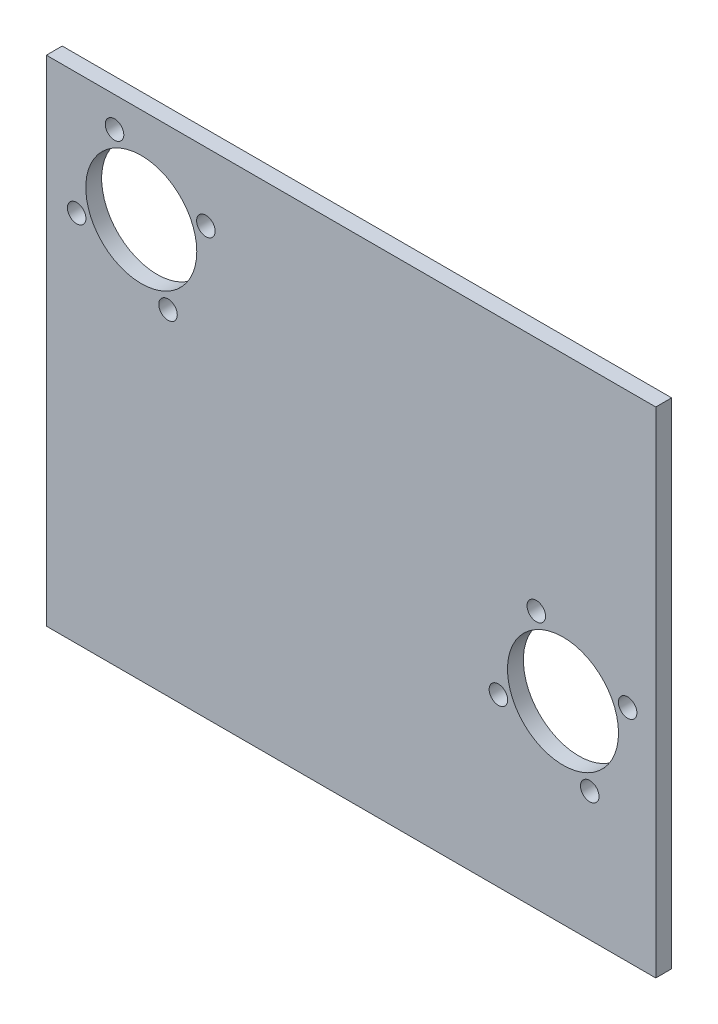
ISO-10303-21;
HEADER;
FILE_DESCRIPTION(('STEP AP214'),'2;1');
FILE_NAME('part.step','',(''),(''),'','','');
FILE_SCHEMA(('AUTOMOTIVE_DESIGN { 1 0 10303 214 1 1 1 1 }'));
ENDSEC;
DATA;
#1=APPLICATION_CONTEXT('core data for automotive mechanical design processes');
#2=APPLICATION_PROTOCOL_DEFINITION('international standard','automotive_design',2000,#1);
#3=PRODUCT_CONTEXT('',#1,'mechanical');
#4=PRODUCT('Part','Part','',(#3));
#5=PRODUCT_RELATED_PRODUCT_CATEGORY('part','',(#4));
#6=PRODUCT_DEFINITION_FORMATION('','',#4);
#7=PRODUCT_DEFINITION_CONTEXT('part definition',#1,'design');
#8=PRODUCT_DEFINITION('design','',#6,#7);
#9=PRODUCT_DEFINITION_SHAPE('','',#8);
#10=(LENGTH_UNIT() NAMED_UNIT(*) SI_UNIT(.MILLI.,.METRE.));
#11=(NAMED_UNIT(*) PLANE_ANGLE_UNIT() SI_UNIT($,.RADIAN.));
#12=(NAMED_UNIT(*) SI_UNIT($,.STERADIAN.) SOLID_ANGLE_UNIT());
#13=UNCERTAINTY_MEASURE_WITH_UNIT(LENGTH_MEASURE(1.E-05),#10,'distance_accuracy_value','');
#14=(GEOMETRIC_REPRESENTATION_CONTEXT(3) GLOBAL_UNCERTAINTY_ASSIGNED_CONTEXT((#13)) GLOBAL_UNIT_ASSIGNED_CONTEXT((#10,
#11,#12)) REPRESENTATION_CONTEXT('',''));
#15=CARTESIAN_POINT('',(0.,0.,0.));
#16=DIRECTION('',(0.,0.,1.));
#17=DIRECTION('',(1.,0.,0.));
#18=AXIS2_PLACEMENT_3D('',#15,#16,#17);
#19=CARTESIAN_POINT('',(-19.,-80.,-3.175));
#20=DIRECTION('',(-1.,0.,0.));
#21=DIRECTION('',(0.,0.,1.));
#22=AXIS2_PLACEMENT_3D('',#19,#20,#21);
#23=PLANE('',#22);
#24=DIRECTION('',(0.,-1.,0.));
#25=VECTOR('',#24,1.);
#26=CARTESIAN_POINT('',(-19.,-80.,0.));
#27=LINE('',#26,#25);
#28=CARTESIAN_POINT('',(-19.,19.,0.));
#29=VERTEX_POINT('',#28);
#30=CARTESIAN_POINT('',(-19.,-80.,0.));
#31=VERTEX_POINT('',#30);
#32=EDGE_CURVE('E98',#29,#31,#27,.T.);
#33=ORIENTED_EDGE('',*,*,#32,.F.);
#34=DIRECTION('',(0.,0.,1.));
#35=VECTOR('',#34,1.);
#36=CARTESIAN_POINT('',(-19.,19.,-3.175));
#37=LINE('',#36,#35);
#38=CARTESIAN_POINT('',(-19.,19.,-3.175));
#39=VERTEX_POINT('',#38);
#40=EDGE_CURVE('E11',#39,#29,#37,.T.);
#41=ORIENTED_EDGE('',*,*,#40,.F.);
#42=DIRECTION('',(0.,-1.,0.));
#43=VECTOR('',#42,1.);
#44=CARTESIAN_POINT('',(-19.,-80.,-3.175));
#45=LINE('',#44,#43);
#46=CARTESIAN_POINT('',(-19.,-80.,-3.175));
#47=VERTEX_POINT('',#46);
#48=EDGE_CURVE('E91',#39,#47,#45,.T.);
#49=ORIENTED_EDGE('',*,*,#48,.T.);
#50=DIRECTION('',(0.,0.,1.));
#51=VECTOR('',#50,1.);
#52=CARTESIAN_POINT('',(-19.,-80.,-3.175));
#53=LINE('',#52,#51);
#54=EDGE_CURVE('E36',#47,#31,#53,.T.);
#55=ORIENTED_EDGE('',*,*,#54,.T.);
#56=EDGE_LOOP('',(#33,#41,#49,#55));
#57=FACE_BOUND('',#56,.T.);
#58=ADVANCED_FACE('F33',(#57),#23,.T.);
#59=CARTESIAN_POINT('',(-19.,19.,-3.175));
#60=DIRECTION('',(0.,1.,0.));
#61=DIRECTION('',(0.,0.,1.));
#62=AXIS2_PLACEMENT_3D('',#59,#60,#61);
#63=PLANE('',#62);
#64=DIRECTION('',(-1.,0.,0.));
#65=VECTOR('',#64,1.);
#66=CARTESIAN_POINT('',(-19.,19.,0.));
#67=LINE('',#66,#65);
#68=CARTESIAN_POINT('',(103.,19.,0.));
#69=VERTEX_POINT('',#68);
#70=EDGE_CURVE('E93',#69,#29,#67,.T.);
#71=ORIENTED_EDGE('',*,*,#70,.F.);
#72=DIRECTION('',(0.,0.,1.));
#73=VECTOR('',#72,1.);
#74=CARTESIAN_POINT('',(103.,19.,-3.175));
#75=LINE('',#74,#73);
#76=CARTESIAN_POINT('',(103.,19.,-3.175));
#77=VERTEX_POINT('',#76);
#78=EDGE_CURVE('E42',#77,#69,#75,.T.);
#79=ORIENTED_EDGE('',*,*,#78,.F.);
#80=DIRECTION('',(-1.,0.,0.));
#81=VECTOR('',#80,1.);
#82=CARTESIAN_POINT('',(-19.,19.,-3.175));
#83=LINE('',#82,#81);
#84=EDGE_CURVE('E88',#77,#39,#83,.T.);
#85=ORIENTED_EDGE('',*,*,#84,.T.);
#86=ORIENTED_EDGE('',*,*,#40,.T.);
#87=EDGE_LOOP('',(#71,#79,#85,#86));
#88=FACE_BOUND('',#87,.T.);
#89=ADVANCED_FACE('F109',(#88),#63,.T.);
#90=CARTESIAN_POINT('',(103.,19.,-3.175));
#91=DIRECTION('',(1.,0.,0.));
#92=DIRECTION('',(0.,1.,0.));
#93=AXIS2_PLACEMENT_3D('',#90,#91,#92);
#94=PLANE('',#93);
#95=DIRECTION('',(0.,1.,0.));
#96=VECTOR('',#95,1.);
#97=CARTESIAN_POINT('',(103.,19.,0.));
#98=LINE('',#97,#96);
#99=CARTESIAN_POINT('',(103.,-80.,0.));
#100=VERTEX_POINT('',#99);
#101=EDGE_CURVE('E83',#100,#69,#98,.T.);
#102=ORIENTED_EDGE('',*,*,#101,.F.);
#103=DIRECTION('',(0.,0.,1.));
#104=VECTOR('',#103,1.);
#105=CARTESIAN_POINT('',(103.,-80.,-3.175));
#106=LINE('',#105,#104);
#107=CARTESIAN_POINT('',(103.,-80.,-3.175));
#108=VERTEX_POINT('',#107);
#109=EDGE_CURVE('E78',#108,#100,#106,.T.);
#110=ORIENTED_EDGE('',*,*,#109,.F.);
#111=DIRECTION('',(0.,1.,0.));
#112=VECTOR('',#111,1.);
#113=CARTESIAN_POINT('',(103.,19.,-3.175));
#114=LINE('',#113,#112);
#115=EDGE_CURVE('E81',#108,#77,#114,.T.);
#116=ORIENTED_EDGE('',*,*,#115,.T.);
#117=ORIENTED_EDGE('',*,*,#78,.T.);
#118=EDGE_LOOP('',(#102,#110,#116,#117));
#119=FACE_BOUND('',#118,.T.);
#120=ADVANCED_FACE('F80',(#119),#94,.T.);
#121=CARTESIAN_POINT('',(-19.,-80.,-3.175));
#122=DIRECTION('',(0.,-1.,0.));
#123=DIRECTION('',(0.,0.,-1.));
#124=AXIS2_PLACEMENT_3D('',#121,#122,#123);
#125=PLANE('',#124);
#126=DIRECTION('',(1.,0.,0.));
#127=VECTOR('',#126,1.);
#128=CARTESIAN_POINT('',(-19.,-80.,0.));
#129=LINE('',#128,#127);
#130=EDGE_CURVE('E101',#31,#100,#129,.T.);
#131=ORIENTED_EDGE('',*,*,#130,.F.);
#132=ORIENTED_EDGE('',*,*,#54,.F.);
#133=DIRECTION('',(1.,0.,0.));
#134=VECTOR('',#133,1.);
#135=CARTESIAN_POINT('',(-19.,-80.,-3.175));
#136=LINE('',#135,#134);
#137=EDGE_CURVE('E87',#47,#108,#136,.T.);
#138=ORIENTED_EDGE('',*,*,#137,.T.);
#139=ORIENTED_EDGE('',*,*,#109,.T.);
#140=EDGE_LOOP('',(#131,#132,#138,#139));
#141=FACE_BOUND('',#140,.T.);
#142=ADVANCED_FACE('F90',(#141),#125,.T.);
#143=CARTESIAN_POINT('',(0.,0.,-3.175));
#144=DIRECTION('',(0.,0.,-1.));
#145=DIRECTION('',(-1.,0.,0.));
#146=AXIS2_PLACEMENT_3D('',#143,#144,#145);
#147=PLANE('',#146);
#148=CARTESIAN_POINT('',(97.3675570306436,-35.9225508456677,-3.175));
#149=DIRECTION('',(0.,0.,1.));
#150=DIRECTION('',(-1.,0.,0.));
#151=AXIS2_PLACEMENT_3D('',#148,#149,#150);
#152=CIRCLE('',#151,1.85420000000002);
#153=CARTESIAN_POINT('',(95.5133570306436,-35.9225508456677,-3.175));
#154=VERTEX_POINT('',#153);
#155=EDGE_CURVE('E174',#154,#154,#152,.T.);
#156=ORIENTED_EDGE('',*,*,#155,.T.);
#157=EDGE_LOOP('',(#156));
#158=FACE_BOUND('',#157,.T.);
#159=CARTESIAN_POINT('',(89.7835735990526,-54.2114325859279,-3.175));
#160=DIRECTION('',(0.,0.,1.));
#161=DIRECTION('',(-1.,0.,0.));
#162=AXIS2_PLACEMENT_3D('',#159,#160,#161);
#163=CIRCLE('',#162,1.85420000000002);
#164=CARTESIAN_POINT('',(87.9293735990526,-54.2114325859279,-3.175));
#165=VERTEX_POINT('',#164);
#166=EDGE_CURVE('E182',#165,#165,#163,.T.);
#167=ORIENTED_EDGE('',*,*,#166,.T.);
#168=EDGE_LOOP('',(#167));
#169=FACE_BOUND('',#168,.T.);
#170=CARTESIAN_POINT('',(71.4946918587924,-46.627449154337,-3.175));
#171=DIRECTION('',(0.,0.,1.));
#172=DIRECTION('',(1.,0.,0.));
#173=AXIS2_PLACEMENT_3D('',#170,#171,#172);
#174=CIRCLE('',#173,1.8542);
#175=CARTESIAN_POINT('',(73.3488918587924,-46.627449154337,-3.175));
#176=VERTEX_POINT('',#175);
#177=EDGE_CURVE('E188',#176,#176,#174,.T.);
#178=ORIENTED_EDGE('',*,*,#177,.T.);
#179=EDGE_LOOP('',(#178));
#180=FACE_BOUND('',#179,.T.);
#181=CARTESIAN_POINT('',(79.0786752903833,-28.3385674140767,-3.175));
#182=DIRECTION('',(0.,0.,1.));
#183=DIRECTION('',(1.,0.,0.));
#184=AXIS2_PLACEMENT_3D('',#181,#182,#183);
#185=CIRCLE('',#184,1.85420000000003);
#186=CARTESIAN_POINT('',(80.9328752903834,-28.3385674140767,-3.175));
#187=VERTEX_POINT('',#186);
#188=EDGE_CURVE('E194',#187,#187,#185,.T.);
#189=ORIENTED_EDGE('',*,*,#188,.T.);
#190=EDGE_LOOP('',(#189));
#191=FACE_BOUND('',#190,.T.);
#192=CARTESIAN_POINT('',(84.431124444718,-41.2750000000023,-3.175));
#193=DIRECTION('',(0.,0.,1.));
#194=DIRECTION('',(1.,0.,0.));
#195=AXIS2_PLACEMENT_3D('',#192,#193,#194);
#196=CIRCLE('',#195,11.1125);
#197=CARTESIAN_POINT('',(95.543624444718,-41.2750000000023,-3.175));
#198=VERTEX_POINT('',#197);
#199=EDGE_CURVE('E200',#198,#198,#196,.T.);
#200=ORIENTED_EDGE('',*,*,#199,.T.);
#201=EDGE_LOOP('',(#200));
#202=FACE_BOUND('',#201,.T.);
#203=CARTESIAN_POINT('',(5.35244915433659,-12.9364325859298,-3.175));
#204=DIRECTION('',(0.,0.,1.));
#205=DIRECTION('',(1.,0.,0.));
#206=AXIS2_PLACEMENT_3D('',#203,#204,#205);
#207=CIRCLE('',#206,1.8542);
#208=CARTESIAN_POINT('',(7.20664915433659,-12.9364325859298,-3.175));
#209=VERTEX_POINT('',#208);
#210=EDGE_CURVE('E206',#209,#209,#207,.T.);
#211=ORIENTED_EDGE('',*,*,#210,.T.);
#212=EDGE_LOOP('',(#211));
#213=FACE_BOUND('',#212,.T.);
#214=CARTESIAN_POINT('',(12.9364325859287,5.35244915433352,-3.175));
#215=DIRECTION('',(0.,0.,1.));
#216=DIRECTION('',(1.,0.,0.));
#217=AXIS2_PLACEMENT_3D('',#214,#215,#216);
#218=CIRCLE('',#217,1.8542);
#219=CARTESIAN_POINT('',(14.7906325859287,5.35244915433352,-3.175));
#220=VERTEX_POINT('',#219);
#221=EDGE_CURVE('E212',#220,#220,#218,.T.);
#222=ORIENTED_EDGE('',*,*,#221,.T.);
#223=EDGE_LOOP('',(#222));
#224=FACE_BOUND('',#223,.T.);
#225=CARTESIAN_POINT('',(-12.9364325859267,-5.35244915433771,-3.175));
#226=DIRECTION('',(0.,0.,1.));
#227=DIRECTION('',(1.,0.,0.));
#228=AXIS2_PLACEMENT_3D('',#225,#226,#227);
#229=CIRCLE('',#228,1.8542);
#230=CARTESIAN_POINT('',(-11.0822325859267,-5.35244915433771,-3.175));
#231=VERTEX_POINT('',#230);
#232=EDGE_CURVE('E218',#231,#231,#229,.T.);
#233=ORIENTED_EDGE('',*,*,#232,.T.);
#234=EDGE_LOOP('',(#233));
#235=FACE_BOUND('',#234,.T.);
#236=CARTESIAN_POINT('',(0.,0.,-3.175));
#237=DIRECTION('',(0.,0.,1.));
#238=DIRECTION('',(1.,0.,0.));
#239=AXIS2_PLACEMENT_3D('',#236,#237,#238);
#240=CIRCLE('',#239,11.1125);
#241=CARTESIAN_POINT('',(11.1125,0.,-3.175));
#242=VERTEX_POINT('',#241);
#243=EDGE_CURVE('E224',#242,#242,#240,.T.);
#244=ORIENTED_EDGE('',*,*,#243,.T.);
#245=EDGE_LOOP('',(#244));
#246=FACE_BOUND('',#245,.T.);
#247=CARTESIAN_POINT('',(-5.35244915433464,12.9364325859256,-3.175));
#248=DIRECTION('',(0.,0.,1.));
#249=DIRECTION('',(1.,0.,0.));
#250=AXIS2_PLACEMENT_3D('',#247,#248,#249);
#251=CIRCLE('',#250,1.8542);
#252=CARTESIAN_POINT('',(-3.49824915433464,12.9364325859256,-3.175));
#253=VERTEX_POINT('',#252);
#254=EDGE_CURVE('E102',#253,#253,#251,.T.);
#255=ORIENTED_EDGE('',*,*,#254,.T.);
#256=EDGE_LOOP('',(#255));
#257=FACE_BOUND('',#256,.T.);
#258=ORIENTED_EDGE('',*,*,#48,.F.);
#259=ORIENTED_EDGE('',*,*,#84,.F.);
#260=ORIENTED_EDGE('',*,*,#115,.F.);
#261=ORIENTED_EDGE('',*,*,#137,.F.);
#262=EDGE_LOOP('',(#258,#259,#260,#261));
#263=FACE_BOUND('',#262,.T.);
#264=ADVANCED_FACE('F86',(#158,#169,#180,#191,#202,#213,#224,#235,#246,#257,#263),#147,.T.);
#265=CARTESIAN_POINT('',(0.,0.,0.));
#266=DIRECTION('',(0.,0.,-1.));
#267=DIRECTION('',(-1.,0.,0.));
#268=AXIS2_PLACEMENT_3D('',#265,#266,#267);
#269=PLANE('',#268);
#270=CARTESIAN_POINT('',(97.3675570306436,-35.9225508456677,0.));
#271=DIRECTION('',(0.,0.,1.));
#272=DIRECTION('',(-1.,0.,0.));
#273=AXIS2_PLACEMENT_3D('',#270,#271,#272);
#274=CIRCLE('',#273,1.85420000000002);
#275=CARTESIAN_POINT('',(95.5133570306436,-35.9225508456677,0.));
#276=VERTEX_POINT('',#275);
#277=EDGE_CURVE('E177',#276,#276,#274,.T.);
#278=ORIENTED_EDGE('',*,*,#277,.F.);
#279=EDGE_LOOP('',(#278));
#280=FACE_BOUND('',#279,.T.);
#281=CARTESIAN_POINT('',(89.7835735990526,-54.2114325859279,0.));
#282=DIRECTION('',(0.,0.,1.));
#283=DIRECTION('',(-1.,0.,0.));
#284=AXIS2_PLACEMENT_3D('',#281,#282,#283);
#285=CIRCLE('',#284,1.85420000000002);
#286=CARTESIAN_POINT('',(87.9293735990526,-54.2114325859279,0.));
#287=VERTEX_POINT('',#286);
#288=EDGE_CURVE('E179',#287,#287,#285,.T.);
#289=ORIENTED_EDGE('',*,*,#288,.F.);
#290=EDGE_LOOP('',(#289));
#291=FACE_BOUND('',#290,.T.);
#292=CARTESIAN_POINT('',(71.4946918587924,-46.627449154337,0.));
#293=DIRECTION('',(0.,0.,1.));
#294=DIRECTION('',(1.,0.,0.));
#295=AXIS2_PLACEMENT_3D('',#292,#293,#294);
#296=CIRCLE('',#295,1.8542);
#297=CARTESIAN_POINT('',(73.3488918587924,-46.627449154337,0.));
#298=VERTEX_POINT('',#297);
#299=EDGE_CURVE('E185',#298,#298,#296,.T.);
#300=ORIENTED_EDGE('',*,*,#299,.F.);
#301=EDGE_LOOP('',(#300));
#302=FACE_BOUND('',#301,.T.);
#303=CARTESIAN_POINT('',(79.0786752903833,-28.3385674140767,0.));
#304=DIRECTION('',(0.,0.,1.));
#305=DIRECTION('',(1.,0.,0.));
#306=AXIS2_PLACEMENT_3D('',#303,#304,#305);
#307=CIRCLE('',#306,1.85420000000003);
#308=CARTESIAN_POINT('',(80.9328752903834,-28.3385674140767,0.));
#309=VERTEX_POINT('',#308);
#310=EDGE_CURVE('E191',#309,#309,#307,.T.);
#311=ORIENTED_EDGE('',*,*,#310,.F.);
#312=EDGE_LOOP('',(#311));
#313=FACE_BOUND('',#312,.T.);
#314=CARTESIAN_POINT('',(84.431124444718,-41.2750000000023,0.));
#315=DIRECTION('',(0.,0.,1.));
#316=DIRECTION('',(1.,0.,0.));
#317=AXIS2_PLACEMENT_3D('',#314,#315,#316);
#318=CIRCLE('',#317,11.1125);
#319=CARTESIAN_POINT('',(95.543624444718,-41.2750000000023,0.));
#320=VERTEX_POINT('',#319);
#321=EDGE_CURVE('E197',#320,#320,#318,.T.);
#322=ORIENTED_EDGE('',*,*,#321,.F.);
#323=EDGE_LOOP('',(#322));
#324=FACE_BOUND('',#323,.T.);
#325=CARTESIAN_POINT('',(5.35244915433659,-12.9364325859298,0.));
#326=DIRECTION('',(0.,0.,1.));
#327=DIRECTION('',(1.,0.,0.));
#328=AXIS2_PLACEMENT_3D('',#325,#326,#327);
#329=CIRCLE('',#328,1.8542);
#330=CARTESIAN_POINT('',(7.20664915433659,-12.9364325859298,0.));
#331=VERTEX_POINT('',#330);
#332=EDGE_CURVE('E203',#331,#331,#329,.T.);
#333=ORIENTED_EDGE('',*,*,#332,.F.);
#334=EDGE_LOOP('',(#333));
#335=FACE_BOUND('',#334,.T.);
#336=CARTESIAN_POINT('',(12.9364325859287,5.35244915433352,0.));
#337=DIRECTION('',(0.,0.,1.));
#338=DIRECTION('',(1.,0.,0.));
#339=AXIS2_PLACEMENT_3D('',#336,#337,#338);
#340=CIRCLE('',#339,1.8542);
#341=CARTESIAN_POINT('',(14.7906325859287,5.35244915433352,0.));
#342=VERTEX_POINT('',#341);
#343=EDGE_CURVE('E209',#342,#342,#340,.T.);
#344=ORIENTED_EDGE('',*,*,#343,.F.);
#345=EDGE_LOOP('',(#344));
#346=FACE_BOUND('',#345,.T.);
#347=CARTESIAN_POINT('',(-12.9364325859267,-5.35244915433771,0.));
#348=DIRECTION('',(0.,0.,1.));
#349=DIRECTION('',(1.,0.,0.));
#350=AXIS2_PLACEMENT_3D('',#347,#348,#349);
#351=CIRCLE('',#350,1.8542);
#352=CARTESIAN_POINT('',(-11.0822325859267,-5.35244915433771,0.));
#353=VERTEX_POINT('',#352);
#354=EDGE_CURVE('E215',#353,#353,#351,.T.);
#355=ORIENTED_EDGE('',*,*,#354,.F.);
#356=EDGE_LOOP('',(#355));
#357=FACE_BOUND('',#356,.T.);
#358=CARTESIAN_POINT('',(0.,0.,0.));
#359=DIRECTION('',(0.,0.,1.));
#360=DIRECTION('',(1.,0.,0.));
#361=AXIS2_PLACEMENT_3D('',#358,#359,#360);
#362=CIRCLE('',#361,11.1125);
#363=CARTESIAN_POINT('',(11.1125,0.,0.));
#364=VERTEX_POINT('',#363);
#365=EDGE_CURVE('E221',#364,#364,#362,.T.);
#366=ORIENTED_EDGE('',*,*,#365,.F.);
#367=EDGE_LOOP('',(#366));
#368=FACE_BOUND('',#367,.T.);
#369=CARTESIAN_POINT('',(-5.35244915433464,12.9364325859256,0.));
#370=DIRECTION('',(0.,0.,1.));
#371=DIRECTION('',(1.,0.,0.));
#372=AXIS2_PLACEMENT_3D('',#369,#370,#371);
#373=CIRCLE('',#372,1.8542);
#374=CARTESIAN_POINT('',(-3.49824915433464,12.9364325859256,0.));
#375=VERTEX_POINT('',#374);
#376=EDGE_CURVE('E227',#375,#375,#373,.T.);
#377=ORIENTED_EDGE('',*,*,#376,.F.);
#378=EDGE_LOOP('',(#377));
#379=FACE_BOUND('',#378,.T.);
#380=ORIENTED_EDGE('',*,*,#32,.T.);
#381=ORIENTED_EDGE('',*,*,#130,.T.);
#382=ORIENTED_EDGE('',*,*,#101,.T.);
#383=ORIENTED_EDGE('',*,*,#70,.T.);
#384=EDGE_LOOP('',(#380,#381,#382,#383));
#385=FACE_BOUND('',#384,.T.);
#386=ADVANCED_FACE('F108',(#280,#291,#302,#313,#324,#335,#346,#357,#368,#379,#385),#269,.F.);
#387=CARTESIAN_POINT('',(-5.35244915433464,12.9364325859256,-3.175));
#388=DIRECTION('',(0.,0.,1.));
#389=DIRECTION('',(1.,0.,0.));
#390=AXIS2_PLACEMENT_3D('',#387,#388,#389);
#391=CYLINDRICAL_SURFACE('',#390,1.8542);
#392=ORIENTED_EDGE('',*,*,#254,.F.);
#393=EDGE_LOOP('',(#392));
#394=FACE_BOUND('',#393,.T.);
#395=ORIENTED_EDGE('',*,*,#376,.T.);
#396=EDGE_LOOP('',(#395));
#397=FACE_BOUND('',#396,.T.);
#398=ADVANCED_FACE('F127',(#394,#397),#391,.F.);
#399=CARTESIAN_POINT('',(0.,0.,-3.175));
#400=DIRECTION('',(0.,0.,1.));
#401=DIRECTION('',(1.,0.,0.));
#402=AXIS2_PLACEMENT_3D('',#399,#400,#401);
#403=CYLINDRICAL_SURFACE('',#402,11.1125);
#404=ORIENTED_EDGE('',*,*,#243,.F.);
#405=EDGE_LOOP('',(#404));
#406=FACE_BOUND('',#405,.T.);
#407=ORIENTED_EDGE('',*,*,#365,.T.);
#408=EDGE_LOOP('',(#407));
#409=FACE_BOUND('',#408,.T.);
#410=ADVANCED_FACE('F134',(#406,#409),#403,.F.);
#411=CARTESIAN_POINT('',(-12.9364325859267,-5.35244915433771,-3.175));
#412=DIRECTION('',(0.,0.,1.));
#413=DIRECTION('',(1.,0.,0.));
#414=AXIS2_PLACEMENT_3D('',#411,#412,#413);
#415=CYLINDRICAL_SURFACE('',#414,1.8542);
#416=ORIENTED_EDGE('',*,*,#232,.F.);
#417=EDGE_LOOP('',(#416));
#418=FACE_BOUND('',#417,.T.);
#419=ORIENTED_EDGE('',*,*,#354,.T.);
#420=EDGE_LOOP('',(#419));
#421=FACE_BOUND('',#420,.T.);
#422=ADVANCED_FACE('F138',(#418,#421),#415,.F.);
#423=CARTESIAN_POINT('',(12.9364325859287,5.35244915433352,-3.175));
#424=DIRECTION('',(0.,0.,1.));
#425=DIRECTION('',(1.,0.,0.));
#426=AXIS2_PLACEMENT_3D('',#423,#424,#425);
#427=CYLINDRICAL_SURFACE('',#426,1.8542);
#428=ORIENTED_EDGE('',*,*,#221,.F.);
#429=EDGE_LOOP('',(#428));
#430=FACE_BOUND('',#429,.T.);
#431=ORIENTED_EDGE('',*,*,#343,.T.);
#432=EDGE_LOOP('',(#431));
#433=FACE_BOUND('',#432,.T.);
#434=ADVANCED_FACE('F142',(#430,#433),#427,.F.);
#435=CARTESIAN_POINT('',(5.35244915433659,-12.9364325859298,-3.175));
#436=DIRECTION('',(0.,0.,1.));
#437=DIRECTION('',(1.,0.,0.));
#438=AXIS2_PLACEMENT_3D('',#435,#436,#437);
#439=CYLINDRICAL_SURFACE('',#438,1.8542);
#440=ORIENTED_EDGE('',*,*,#210,.F.);
#441=EDGE_LOOP('',(#440));
#442=FACE_BOUND('',#441,.T.);
#443=ORIENTED_EDGE('',*,*,#332,.T.);
#444=EDGE_LOOP('',(#443));
#445=FACE_BOUND('',#444,.T.);
#446=ADVANCED_FACE('F146',(#442,#445),#439,.F.);
#447=CARTESIAN_POINT('',(84.431124444718,-41.2750000000023,-3.175));
#448=DIRECTION('',(0.,0.,1.));
#449=DIRECTION('',(1.,0.,0.));
#450=AXIS2_PLACEMENT_3D('',#447,#448,#449);
#451=CYLINDRICAL_SURFACE('',#450,11.1125);
#452=ORIENTED_EDGE('',*,*,#199,.F.);
#453=EDGE_LOOP('',(#452));
#454=FACE_BOUND('',#453,.T.);
#455=ORIENTED_EDGE('',*,*,#321,.T.);
#456=EDGE_LOOP('',(#455));
#457=FACE_BOUND('',#456,.T.);
#458=ADVANCED_FACE('F150',(#454,#457),#451,.F.);
#459=CARTESIAN_POINT('',(79.0786752903833,-28.3385674140767,-3.175));
#460=DIRECTION('',(0.,0.,1.));
#461=DIRECTION('',(1.,0.,0.));
#462=AXIS2_PLACEMENT_3D('',#459,#460,#461);
#463=CYLINDRICAL_SURFACE('',#462,1.85420000000003);
#464=ORIENTED_EDGE('',*,*,#188,.F.);
#465=EDGE_LOOP('',(#464));
#466=FACE_BOUND('',#465,.T.);
#467=ORIENTED_EDGE('',*,*,#310,.T.);
#468=EDGE_LOOP('',(#467));
#469=FACE_BOUND('',#468,.T.);
#470=ADVANCED_FACE('F154',(#466,#469),#463,.F.);
#471=CARTESIAN_POINT('',(71.4946918587924,-46.627449154337,-3.175));
#472=DIRECTION('',(0.,0.,1.));
#473=DIRECTION('',(1.,0.,0.));
#474=AXIS2_PLACEMENT_3D('',#471,#472,#473);
#475=CYLINDRICAL_SURFACE('',#474,1.8542);
#476=ORIENTED_EDGE('',*,*,#177,.F.);
#477=EDGE_LOOP('',(#476));
#478=FACE_BOUND('',#477,.T.);
#479=ORIENTED_EDGE('',*,*,#299,.T.);
#480=EDGE_LOOP('',(#479));
#481=FACE_BOUND('',#480,.T.);
#482=ADVANCED_FACE('F158',(#478,#481),#475,.F.);
#483=CARTESIAN_POINT('',(89.7835735990526,-54.2114325859279,-3.175));
#484=DIRECTION('',(0.,0.,1.));
#485=DIRECTION('',(1.,0.,0.));
#486=AXIS2_PLACEMENT_3D('',#483,#484,#485);
#487=CYLINDRICAL_SURFACE('',#486,1.85420000000002);
#488=ORIENTED_EDGE('',*,*,#166,.F.);
#489=EDGE_LOOP('',(#488));
#490=FACE_BOUND('',#489,.T.);
#491=ORIENTED_EDGE('',*,*,#288,.T.);
#492=EDGE_LOOP('',(#491));
#493=FACE_BOUND('',#492,.T.);
#494=ADVANCED_FACE('F162',(#490,#493),#487,.F.);
#495=CARTESIAN_POINT('',(97.3675570306436,-35.9225508456677,-3.175));
#496=DIRECTION('',(0.,0.,1.));
#497=DIRECTION('',(1.,0.,0.));
#498=AXIS2_PLACEMENT_3D('',#495,#496,#497);
#499=CYLINDRICAL_SURFACE('',#498,1.85420000000002);
#500=ORIENTED_EDGE('',*,*,#155,.F.);
#501=EDGE_LOOP('',(#500));
#502=FACE_BOUND('',#501,.T.);
#503=ORIENTED_EDGE('',*,*,#277,.T.);
#504=EDGE_LOOP('',(#503));
#505=FACE_BOUND('',#504,.T.);
#506=ADVANCED_FACE('F166',(#502,#505),#499,.F.);
#507=CLOSED_SHELL('',(#58,#89,#120,#142,#264,#386,#398,#410,#422,#434,#446,#458,#470,#482,#494,#506));
#508=MANIFOLD_SOLID_BREP('B2',#507);
#509=ADVANCED_BREP_SHAPE_REPRESENTATION('',(#18,#508),#14);
#510=SHAPE_DEFINITION_REPRESENTATION(#9,#509);
ENDSEC;
END-ISO-10303-21;
